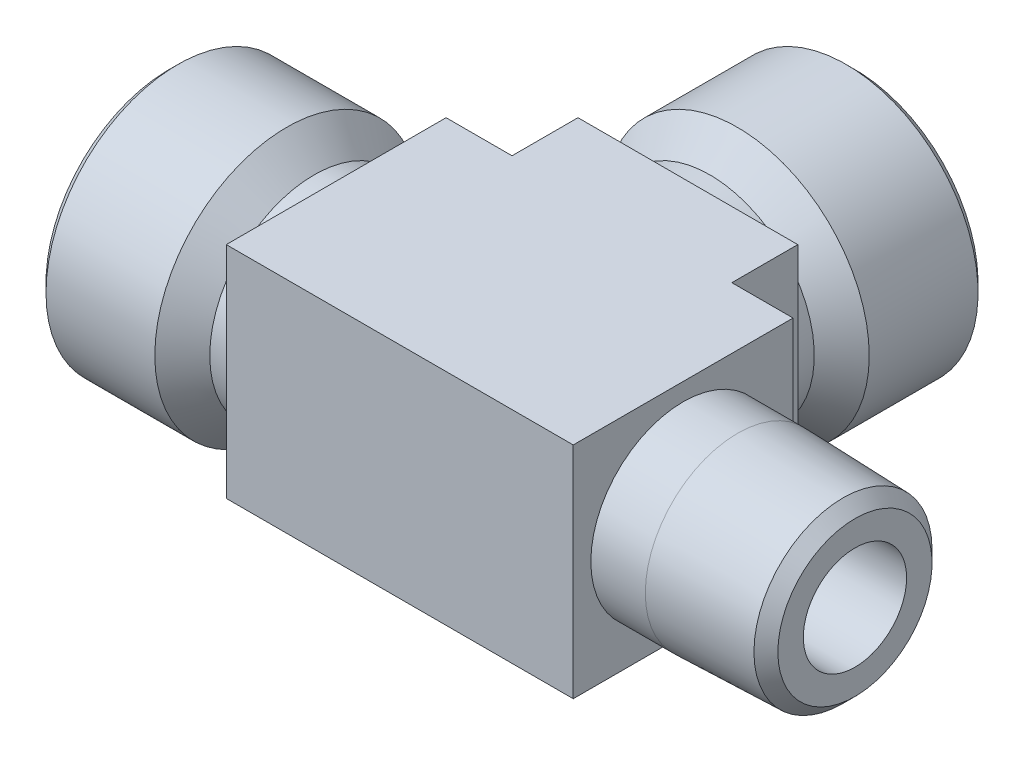
ISO-10303-21;
HEADER;
FILE_DESCRIPTION(('STEP AP214'),'2;1');
FILE_NAME('part.step','',(''),(''),'','','');
FILE_SCHEMA(('AUTOMOTIVE_DESIGN { 1 0 10303 214 1 1 1 1 }'));
ENDSEC;
DATA;
#1=APPLICATION_CONTEXT('core data for automotive mechanical design processes');
#2=APPLICATION_PROTOCOL_DEFINITION('international standard','automotive_design',2000,#1);
#3=PRODUCT_CONTEXT('',#1,'mechanical');
#4=PRODUCT('Part','Part','',(#3));
#5=PRODUCT_RELATED_PRODUCT_CATEGORY('part','',(#4));
#6=PRODUCT_DEFINITION_FORMATION('','',#4);
#7=PRODUCT_DEFINITION_CONTEXT('part definition',#1,'design');
#8=PRODUCT_DEFINITION('design','',#6,#7);
#9=PRODUCT_DEFINITION_SHAPE('','',#8);
#10=(LENGTH_UNIT() NAMED_UNIT(*) SI_UNIT(.MILLI.,.METRE.));
#11=(NAMED_UNIT(*) PLANE_ANGLE_UNIT() SI_UNIT($,.RADIAN.));
#12=(NAMED_UNIT(*) SI_UNIT($,.STERADIAN.) SOLID_ANGLE_UNIT());
#13=UNCERTAINTY_MEASURE_WITH_UNIT(LENGTH_MEASURE(1.E-05),#10,'distance_accuracy_value','');
#14=(GEOMETRIC_REPRESENTATION_CONTEXT(3) GLOBAL_UNCERTAINTY_ASSIGNED_CONTEXT((#13)) GLOBAL_UNIT_ASSIGNED_CONTEXT((#10,
#11,#12)) REPRESENTATION_CONTEXT('',''));
#15=CARTESIAN_POINT('',(0.,0.,0.));
#16=DIRECTION('',(0.,0.,1.));
#17=DIRECTION('',(1.,0.,0.));
#18=AXIS2_PLACEMENT_3D('',#15,#16,#17);
#19=CARTESIAN_POINT('',(39.624,0.,-19.812));
#20=DIRECTION('',(0.,0.,1.));
#21=DIRECTION('',(1.,0.,0.));
#22=AXIS2_PLACEMENT_3D('',#19,#20,#21);
#23=CYLINDRICAL_SURFACE('',#22,8.84936340276164);
#24=CARTESIAN_POINT('',(39.624,0.,0.));
#25=DIRECTION('',(-0.707106781186548,0.,0.707106781186547));
#26=DIRECTION('',(0.707106781186547,0.,0.707106781186547));
#27=AXIS2_PLACEMENT_3D('',#24,#25,#26);
#28=ELLIPSE('',#27,12.5148897425536,8.84936340276164);
#29=CARTESIAN_POINT('',(39.624,8.84936340276164,0.));
#30=VERTEX_POINT('',#29);
#31=CARTESIAN_POINT('',(39.624,-8.84936340276164,0.));
#32=VERTEX_POINT('',#31);
#33=EDGE_CURVE('E101',#30,#32,#28,.T.);
#34=ORIENTED_EDGE('',*,*,#33,.T.);
#35=CARTESIAN_POINT('',(39.624,0.,0.));
#36=DIRECTION('',(0.707106781186547,0.,0.707106781186547));
#37=DIRECTION('',(-0.707106781186548,0.,0.707106781186547));
#38=AXIS2_PLACEMENT_3D('',#35,#36,#37);
#39=ELLIPSE('',#38,12.5148897425536,8.84936340276164);
#40=CARTESIAN_POINT('',(48.4733634027616,0.,-8.84936340276163));
#41=VERTEX_POINT('',#40);
#42=EDGE_CURVE('E19',#32,#41,#39,.T.);
#43=ORIENTED_EDGE('',*,*,#42,.T.);
#44=CARTESIAN_POINT('',(39.624,0.,0.));
#45=DIRECTION('',(0.707106781186547,0.,0.707106781186547));
#46=DIRECTION('',(-0.707106781186548,0.,0.707106781186547));
#47=AXIS2_PLACEMENT_3D('',#44,#45,#46);
#48=ELLIPSE('',#47,12.5148897425536,8.84936340276164);
#49=EDGE_CURVE('E93',#41,#30,#48,.T.);
#50=ORIENTED_EDGE('',*,*,#49,.T.);
#51=EDGE_LOOP('',(#34,#43,#50));
#52=FACE_BOUND('',#51,.T.);
#53=CARTESIAN_POINT('',(39.624,0.,-26.05278));
#54=DIRECTION('',(0.,0.,-1.));
#55=DIRECTION('',(1.,0.,0.));
#56=AXIS2_PLACEMENT_3D('',#53,#54,#55);
#57=CIRCLE('',#56,8.84936340276164);
#58=CARTESIAN_POINT('',(48.4733634027616,0.,-26.05278));
#59=VERTEX_POINT('',#58);
#60=EDGE_CURVE('E109',#59,#59,#57,.T.);
#61=ORIENTED_EDGE('',*,*,#60,.T.);
#62=EDGE_LOOP('',(#61));
#63=FACE_BOUND('',#62,.T.);
#64=ADVANCED_FACE('F16',(#52,#63),#23,.F.);
#65=CARTESIAN_POINT('',(1.45135600000002,0.,0.));
#66=DIRECTION('',(-1.,0.,0.));
#67=DIRECTION('',(0.,0.,1.));
#68=AXIS2_PLACEMENT_3D('',#65,#66,#67);
#69=CONICAL_SURFACE('',#68,9.160383,0.0256563400043175);
#70=CARTESIAN_POINT('',(13.57122,0.,0.));
#71=DIRECTION('',(1.,0.,0.));
#72=DIRECTION('',(0.,0.,-1.));
#73=AXIS2_PLACEMENT_3D('',#70,#71,#72);
#74=CIRCLE('',#73,8.84936340276164);
#75=CARTESIAN_POINT('',(13.57122,0.,-8.84936340276164));
#76=VERTEX_POINT('',#75);
#77=EDGE_CURVE('E102',#76,#76,#74,.T.);
#78=ORIENTED_EDGE('',*,*,#77,.T.);
#79=EDGE_LOOP('',(#78));
#80=FACE_BOUND('',#79,.T.);
#81=CARTESIAN_POINT('',(1.451356,0.,0.));
#82=DIRECTION('',(-1.,0.,0.));
#83=DIRECTION('',(0.,0.,-1.));
#84=AXIS2_PLACEMENT_3D('',#81,#82,#83);
#85=CIRCLE('',#84,9.160383);
#86=CARTESIAN_POINT('',(1.451356,0.,-9.160383));
#87=VERTEX_POINT('',#86);
#88=EDGE_CURVE('E96',#87,#87,#85,.T.);
#89=ORIENTED_EDGE('',*,*,#88,.T.);
#90=EDGE_LOOP('',(#89));
#91=FACE_BOUND('',#90,.T.);
#92=ADVANCED_FACE('F326',(#80,#91),#69,.F.);
#93=CARTESIAN_POINT('',(24.2366817013808,0.,0.));
#94=DIRECTION('',(1.,0.,0.));
#95=DIRECTION('',(0.,0.,-1.));
#96=AXIS2_PLACEMENT_3D('',#93,#94,#95);
#97=CYLINDRICAL_SURFACE('',#96,8.84936340276164);
#98=CARTESIAN_POINT('',(48.4733634027616,0.,0.));
#99=DIRECTION('',(-1.,0.,0.));
#100=DIRECTION('',(0.,0.,-1.));
#101=AXIS2_PLACEMENT_3D('',#98,#99,#100);
#102=CIRCLE('',#101,8.84936340276164);
#103=EDGE_CURVE('E88',#41,#41,#102,.F.);
#104=ORIENTED_EDGE('',*,*,#103,.T.);
#105=ORIENTED_EDGE('',*,*,#42,.F.);
#106=ORIENTED_EDGE('',*,*,#33,.F.);
#107=ORIENTED_EDGE('',*,*,#49,.F.);
#108=EDGE_LOOP('',(#104,#105,#106,#107));
#109=FACE_BOUND('',#108,.T.);
#110=ORIENTED_EDGE('',*,*,#77,.F.);
#111=EDGE_LOOP('',(#110));
#112=FACE_BOUND('',#111,.T.);
#113=ADVANCED_FACE('F90',(#109,#112),#97,.F.);
#114=CARTESIAN_POINT('',(39.624,0.,-38.172644));
#115=DIRECTION('',(0.,0.,-1.));
#116=DIRECTION('',(-1.,0.,0.));
#117=AXIS2_PLACEMENT_3D('',#114,#115,#116);
#118=CONICAL_SURFACE('',#117,9.160383,0.025656340004316);
#119=ORIENTED_EDGE('',*,*,#60,.F.);
#120=EDGE_LOOP('',(#119));
#121=FACE_BOUND('',#120,.T.);
#122=CARTESIAN_POINT('',(39.624,0.,-38.172644));
#123=DIRECTION('',(0.,0.,-1.));
#124=DIRECTION('',(1.,0.,0.));
#125=AXIS2_PLACEMENT_3D('',#122,#123,#124);
#126=CIRCLE('',#125,9.16038300000001);
#127=CARTESIAN_POINT('',(48.784383,0.,-38.172644));
#128=VERTEX_POINT('',#127);
#129=EDGE_CURVE('E95',#128,#128,#126,.T.);
#130=ORIENTED_EDGE('',*,*,#129,.T.);
#131=EDGE_LOOP('',(#130));
#132=FACE_BOUND('',#131,.T.);
#133=ADVANCED_FACE('F425',(#121,#132),#118,.F.);
#134=CARTESIAN_POINT('',(0.,0.,0.));
#135=DIRECTION('',(-1.,0.,0.));
#136=DIRECTION('',(0.,0.,1.));
#137=AXIS2_PLACEMENT_3D('',#134,#135,#136);
#138=CONICAL_SURFACE('',#137,10.611739,0.785398163397448);
#139=ORIENTED_EDGE('',*,*,#88,.F.);
#140=EDGE_LOOP('',(#139));
#141=FACE_BOUND('',#140,.T.);
#142=CARTESIAN_POINT('',(0.,0.,0.));
#143=DIRECTION('',(-1.,0.,0.));
#144=DIRECTION('',(0.,0.,1.));
#145=AXIS2_PLACEMENT_3D('',#142,#143,#144);
#146=CIRCLE('',#145,10.611739);
#147=CARTESIAN_POINT('',(0.,0.,10.611739));
#148=VERTEX_POINT('',#147);
#149=EDGE_CURVE('E144',#148,#148,#146,.F.);
#150=ORIENTED_EDGE('',*,*,#149,.F.);
#151=EDGE_LOOP('',(#150));
#152=FACE_BOUND('',#151,.T.);
#153=ADVANCED_FACE('F384',(#141,#152),#138,.F.);
#154=CARTESIAN_POINT('',(48.4733634027616,0.,0.));
#155=DIRECTION('',(-1.,0.,0.));
#156=DIRECTION('',(0.,-1.,0.));
#157=AXIS2_PLACEMENT_3D('',#154,#155,#156);
#158=CONICAL_SURFACE('',#157,8.84936340276164,0.449593460375112);
#159=CARTESIAN_POINT('',(54.4423634027616,0.,0.));
#160=DIRECTION('',(1.,0.,0.));
#161=DIRECTION('',(0.,0.,-1.));
#162=AXIS2_PLACEMENT_3D('',#159,#160,#161);
#163=CIRCLE('',#162,5.969);
#164=CARTESIAN_POINT('',(54.4423634027616,0.,-5.969));
#165=VERTEX_POINT('',#164);
#166=EDGE_CURVE('E143',#165,#165,#163,.T.);
#167=ORIENTED_EDGE('',*,*,#166,.T.);
#168=EDGE_LOOP('',(#167));
#169=FACE_BOUND('',#168,.T.);
#170=ORIENTED_EDGE('',*,*,#103,.F.);
#171=EDGE_LOOP('',(#170));
#172=FACE_BOUND('',#171,.T.);
#173=ADVANCED_FACE('F379',(#169,#172),#158,.F.);
#174=CARTESIAN_POINT('',(39.624,0.,-39.624));
#175=DIRECTION('',(0.,0.,-1.));
#176=DIRECTION('',(-1.,0.,0.));
#177=AXIS2_PLACEMENT_3D('',#174,#175,#176);
#178=CONICAL_SURFACE('',#177,10.611739,0.785398163397448);
#179=ORIENTED_EDGE('',*,*,#129,.F.);
#180=EDGE_LOOP('',(#179));
#181=FACE_BOUND('',#180,.T.);
#182=CARTESIAN_POINT('',(39.624,0.,-39.624));
#183=DIRECTION('',(0.,0.,-1.));
#184=DIRECTION('',(-1.,0.,0.));
#185=AXIS2_PLACEMENT_3D('',#182,#183,#184);
#186=CIRCLE('',#185,10.611739);
#187=CARTESIAN_POINT('',(29.012261,0.,-39.624));
#188=VERTEX_POINT('',#187);
#189=EDGE_CURVE('E140',#188,#188,#186,.F.);
#190=ORIENTED_EDGE('',*,*,#189,.F.);
#191=EDGE_LOOP('',(#190));
#192=FACE_BOUND('',#191,.T.);
#193=ADVANCED_FACE('F383',(#181,#192),#178,.F.);
#194=CARTESIAN_POINT('',(0.,0.,-7.62));
#195=DIRECTION('',(-1.,0.,0.));
#196=DIRECTION('',(0.,0.,1.));
#197=AXIS2_PLACEMENT_3D('',#194,#195,#196);
#198=PLANE('',#197);
#199=ORIENTED_EDGE('',*,*,#149,.T.);
#200=EDGE_LOOP('',(#199));
#201=FACE_BOUND('',#200,.T.);
#202=CARTESIAN_POINT('',(0.,0.,0.));
#203=DIRECTION('',(1.,0.,0.));
#204=DIRECTION('',(0.,0.,-1.));
#205=AXIS2_PLACEMENT_3D('',#202,#203,#204);
#206=CIRCLE('',#205,14.224);
#207=CARTESIAN_POINT('',(0.,0.,-14.224));
#208=VERTEX_POINT('',#207);
#209=EDGE_CURVE('E137',#208,#208,#206,.T.);
#210=ORIENTED_EDGE('',*,*,#209,.F.);
#211=EDGE_LOOP('',(#210));
#212=FACE_BOUND('',#211,.T.);
#213=ADVANCED_FACE('F458',(#201,#212),#198,.T.);
#214=CARTESIAN_POINT('',(69.32295,0.,0.));
#215=DIRECTION('',(1.,0.,0.));
#216=DIRECTION('',(0.,0.,-1.));
#217=AXIS2_PLACEMENT_3D('',#214,#215,#216);
#218=CYLINDRICAL_SURFACE('',#217,5.969);
#219=CARTESIAN_POINT('',(79.248,0.,0.));
#220=DIRECTION('',(1.,0.,0.));
#221=DIRECTION('',(0.,0.,-1.));
#222=AXIS2_PLACEMENT_3D('',#219,#220,#221);
#223=CIRCLE('',#222,5.969);
#224=CARTESIAN_POINT('',(79.248,0.,-5.969));
#225=VERTEX_POINT('',#224);
#226=EDGE_CURVE('E134',#225,#225,#223,.F.);
#227=ORIENTED_EDGE('',*,*,#226,.F.);
#228=EDGE_LOOP('',(#227));
#229=FACE_BOUND('',#228,.T.);
#230=ORIENTED_EDGE('',*,*,#166,.F.);
#231=EDGE_LOOP('',(#230));
#232=FACE_BOUND('',#231,.T.);
#233=ADVANCED_FACE('F470',(#229,#232),#218,.F.);
#234=CARTESIAN_POINT('',(47.244,0.,-39.624));
#235=DIRECTION('',(0.,0.,-1.));
#236=DIRECTION('',(-1.,0.,0.));
#237=AXIS2_PLACEMENT_3D('',#234,#235,#236);
#238=PLANE('',#237);
#239=ORIENTED_EDGE('',*,*,#189,.T.);
#240=EDGE_LOOP('',(#239));
#241=FACE_BOUND('',#240,.T.);
#242=CARTESIAN_POINT('',(39.624,0.,-39.624));
#243=DIRECTION('',(0.,0.,1.));
#244=DIRECTION('',(0.,-1.,0.));
#245=AXIS2_PLACEMENT_3D('',#242,#243,#244);
#246=CIRCLE('',#245,14.224);
#247=CARTESIAN_POINT('',(39.624,-14.224,-39.624));
#248=VERTEX_POINT('',#247);
#249=EDGE_CURVE('E131',#248,#248,#246,.T.);
#250=ORIENTED_EDGE('',*,*,#249,.F.);
#251=EDGE_LOOP('',(#250));
#252=FACE_BOUND('',#251,.T.);
#253=ADVANCED_FACE('F482',(#241,#252),#238,.T.);
#254=CARTESIAN_POINT('',(1.016,0.,0.));
#255=DIRECTION('',(1.,0.,0.));
#256=DIRECTION('',(0.,0.,-1.));
#257=AXIS2_PLACEMENT_3D('',#254,#255,#256);
#258=CONICAL_SURFACE('',#257,15.24,0.785398163397449);
#259=ORIENTED_EDGE('',*,*,#209,.T.);
#260=EDGE_LOOP('',(#259));
#261=FACE_BOUND('',#260,.T.);
#262=CARTESIAN_POINT('',(1.016,0.,0.));
#263=DIRECTION('',(-1.,0.,0.));
#264=DIRECTION('',(0.,0.,1.));
#265=AXIS2_PLACEMENT_3D('',#262,#263,#264);
#266=CIRCLE('',#265,15.24);
#267=CARTESIAN_POINT('',(1.016,0.,15.24));
#268=VERTEX_POINT('',#267);
#269=EDGE_CURVE('E130',#268,#268,#266,.F.);
#270=ORIENTED_EDGE('',*,*,#269,.F.);
#271=EDGE_LOOP('',(#270));
#272=FACE_BOUND('',#271,.T.);
#273=ADVANCED_FACE('F371',(#261,#272),#258,.T.);
#274=CARTESIAN_POINT('',(79.248,0.,-5.12296664965317));
#275=DIRECTION('',(1.,0.,0.));
#276=DIRECTION('',(0.,0.,-1.));
#277=AXIS2_PLACEMENT_3D('',#274,#275,#276);
#278=PLANE('',#277);
#279=CARTESIAN_POINT('',(79.248,0.,0.));
#280=DIRECTION('',(-1.,0.,0.));
#281=DIRECTION('',(0.,0.,1.));
#282=AXIS2_PLACEMENT_3D('',#279,#280,#281);
#283=CIRCLE('',#282,8.90650999999998);
#284=CARTESIAN_POINT('',(79.248,0.,8.90650999999998));
#285=VERTEX_POINT('',#284);
#286=EDGE_CURVE('E126',#285,#285,#283,.T.);
#287=ORIENTED_EDGE('',*,*,#286,.F.);
#288=EDGE_LOOP('',(#287));
#289=FACE_BOUND('',#288,.T.);
#290=ORIENTED_EDGE('',*,*,#226,.T.);
#291=EDGE_LOOP('',(#290));
#292=FACE_BOUND('',#291,.T.);
#293=ADVANCED_FACE('F354',(#289,#292),#278,.T.);
#294=CARTESIAN_POINT('',(39.624,0.,-38.608));
#295=DIRECTION('',(0.,0.,1.));
#296=DIRECTION('',(0.,-1.,0.));
#297=AXIS2_PLACEMENT_3D('',#294,#295,#296);
#298=CONICAL_SURFACE('',#297,15.24,0.785398163397448);
#299=CARTESIAN_POINT('',(39.624,0.,-38.608));
#300=DIRECTION('',(0.,0.,-1.));
#301=DIRECTION('',(-1.,0.,0.));
#302=AXIS2_PLACEMENT_3D('',#299,#300,#301);
#303=CIRCLE('',#302,15.24);
#304=CARTESIAN_POINT('',(24.384,0.,-38.608));
#305=VERTEX_POINT('',#304);
#306=EDGE_CURVE('E129',#305,#305,#303,.F.);
#307=ORIENTED_EDGE('',*,*,#306,.F.);
#308=EDGE_LOOP('',(#307));
#309=FACE_BOUND('',#308,.T.);
#310=ORIENTED_EDGE('',*,*,#249,.T.);
#311=EDGE_LOOP('',(#310));
#312=FACE_BOUND('',#311,.T.);
#313=ADVANCED_FACE('F349',(#309,#312),#298,.T.);
#314=CARTESIAN_POINT('',(8.382,0.,0.));
#315=DIRECTION('',(-1.,0.,0.));
#316=DIRECTION('',(0.,0.,1.));
#317=AXIS2_PLACEMENT_3D('',#314,#315,#316);
#318=CYLINDRICAL_SURFACE('',#317,15.24);
#319=CARTESIAN_POINT('',(13.589,0.,0.));
#320=DIRECTION('',(-1.,0.,0.));
#321=DIRECTION('',(0.,0.,-1.));
#322=AXIS2_PLACEMENT_3D('',#319,#320,#321);
#323=CIRCLE('',#322,15.24);
#324=CARTESIAN_POINT('',(13.589,0.,-15.24));
#325=VERTEX_POINT('',#324);
#326=EDGE_CURVE('E163',#325,#325,#323,.F.);
#327=ORIENTED_EDGE('',*,*,#326,.F.);
#328=EDGE_LOOP('',(#327));
#329=FACE_BOUND('',#328,.T.);
#330=ORIENTED_EDGE('',*,*,#269,.T.);
#331=EDGE_LOOP('',(#330));
#332=FACE_BOUND('',#331,.T.);
#333=ADVANCED_FACE('F306',(#329,#332),#318,.T.);
#334=CARTESIAN_POINT('',(77.8655334766456,0.,0.));
#335=DIRECTION('',(-1.,0.,0.));
#336=DIRECTION('',(0.,0.,1.));
#337=AXIS2_PLACEMENT_3D('',#334,#335,#336);
#338=CONICAL_SURFACE('',#337,10.2889765233544,0.785398163397448);
#339=CARTESIAN_POINT('',(77.8655334766456,0.,0.));
#340=DIRECTION('',(-1.,0.,0.));
#341=DIRECTION('',(0.,0.,-1.));
#342=AXIS2_PLACEMENT_3D('',#339,#340,#341);
#343=CIRCLE('',#342,10.2889765233545);
#344=CARTESIAN_POINT('',(77.8655334766456,0.,-10.2889765233545));
#345=VERTEX_POINT('',#344);
#346=EDGE_CURVE('E166',#345,#345,#343,.T.);
#347=ORIENTED_EDGE('',*,*,#346,.F.);
#348=EDGE_LOOP('',(#347));
#349=FACE_BOUND('',#348,.T.);
#350=ORIENTED_EDGE('',*,*,#286,.T.);
#351=EDGE_LOOP('',(#350));
#352=FACE_BOUND('',#351,.T.);
#353=ADVANCED_FACE('F520',(#349,#352),#338,.T.);
#354=CARTESIAN_POINT('',(39.624,0.,-31.242));
#355=DIRECTION('',(0.,0.,-1.));
#356=DIRECTION('',(-1.,0.,0.));
#357=AXIS2_PLACEMENT_3D('',#354,#355,#356);
#358=CYLINDRICAL_SURFACE('',#357,15.24);
#359=CARTESIAN_POINT('',(39.624,0.,-26.035));
#360=DIRECTION('',(0.,0.,-1.));
#361=DIRECTION('',(1.,0.,0.));
#362=AXIS2_PLACEMENT_3D('',#359,#360,#361);
#363=CIRCLE('',#362,15.24);
#364=CARTESIAN_POINT('',(54.864,0.,-26.035));
#365=VERTEX_POINT('',#364);
#366=EDGE_CURVE('E169',#365,#365,#363,.F.);
#367=ORIENTED_EDGE('',*,*,#366,.F.);
#368=EDGE_LOOP('',(#367));
#369=FACE_BOUND('',#368,.T.);
#370=ORIENTED_EDGE('',*,*,#306,.T.);
#371=EDGE_LOOP('',(#370));
#372=FACE_BOUND('',#371,.T.);
#373=ADVANCED_FACE('F531',(#369,#372),#358,.T.);
#374=CARTESIAN_POINT('',(13.589,0.,0.));
#375=DIRECTION('',(-1.,0.,0.));
#376=DIRECTION('',(0.,0.,1.));
#377=AXIS2_PLACEMENT_3D('',#374,#375,#376);
#378=CONICAL_SURFACE('',#377,15.24,0.785398163397448);
#379=CARTESIAN_POINT('',(16.764,0.,0.));
#380=DIRECTION('',(-1.,0.,0.));
#381=DIRECTION('',(0.,0.,1.));
#382=AXIS2_PLACEMENT_3D('',#379,#380,#381);
#383=CIRCLE('',#382,12.065);
#384=CARTESIAN_POINT('',(16.764,0.,12.065));
#385=VERTEX_POINT('',#384);
#386=EDGE_CURVE('E172',#385,#385,#383,.F.);
#387=ORIENTED_EDGE('',*,*,#386,.F.);
#388=EDGE_LOOP('',(#387));
#389=FACE_BOUND('',#388,.T.);
#390=ORIENTED_EDGE('',*,*,#326,.T.);
#391=EDGE_LOOP('',(#390));
#392=FACE_BOUND('',#391,.T.);
#393=ADVANCED_FACE('F543',(#389,#392),#378,.T.);
#394=CARTESIAN_POINT('',(65.6920200000001,0.,0.));
#395=DIRECTION('',(-1.,0.,0.));
#396=DIRECTION('',(0.,0.,1.));
#397=AXIS2_PLACEMENT_3D('',#394,#395,#396);
#398=CONICAL_SURFACE('',#397,10.668,0.0311250383214148);
#399=CARTESIAN_POINT('',(65.69202,0.,0.));
#400=DIRECTION('',(-1.,0.,0.));
#401=DIRECTION('',(0.,0.,1.));
#402=AXIS2_PLACEMENT_3D('',#399,#400,#401);
#403=CIRCLE('',#402,10.668);
#404=CARTESIAN_POINT('',(65.69202,0.,10.668));
#405=VERTEX_POINT('',#404);
#406=EDGE_CURVE('E175',#405,#405,#403,.T.);
#407=ORIENTED_EDGE('',*,*,#406,.F.);
#408=EDGE_LOOP('',(#407));
#409=FACE_BOUND('',#408,.T.);
#410=ORIENTED_EDGE('',*,*,#346,.T.);
#411=EDGE_LOOP('',(#410));
#412=FACE_BOUND('',#411,.T.);
#413=ADVANCED_FACE('F555',(#409,#412),#398,.T.);
#414=CARTESIAN_POINT('',(39.624,0.,-26.035));
#415=DIRECTION('',(0.,0.,-1.));
#416=DIRECTION('',(0.,1.,0.));
#417=AXIS2_PLACEMENT_3D('',#414,#415,#416);
#418=CONICAL_SURFACE('',#417,15.24,0.785398163397448);
#419=CARTESIAN_POINT('',(39.624,0.,-22.86));
#420=DIRECTION('',(0.,0.,-1.));
#421=DIRECTION('',(-1.,0.,0.));
#422=AXIS2_PLACEMENT_3D('',#419,#420,#421);
#423=CIRCLE('',#422,12.065);
#424=CARTESIAN_POINT('',(27.559,0.,-22.86));
#425=VERTEX_POINT('',#424);
#426=EDGE_CURVE('E178',#425,#425,#423,.F.);
#427=ORIENTED_EDGE('',*,*,#426,.F.);
#428=EDGE_LOOP('',(#427));
#429=FACE_BOUND('',#428,.T.);
#430=ORIENTED_EDGE('',*,*,#366,.T.);
#431=EDGE_LOOP('',(#430));
#432=FACE_BOUND('',#431,.T.);
#433=ADVANCED_FACE('F567',(#429,#432),#418,.T.);
#434=CARTESIAN_POINT('',(18.034,0.,0.));
#435=DIRECTION('',(-1.,0.,0.));
#436=DIRECTION('',(0.,0.,1.));
#437=AXIS2_PLACEMENT_3D('',#434,#435,#436);
#438=CYLINDRICAL_SURFACE('',#437,12.065);
#439=CARTESIAN_POINT('',(19.304,0.,0.));
#440=DIRECTION('',(-1.,0.,0.));
#441=DIRECTION('',(0.,0.,1.));
#442=AXIS2_PLACEMENT_3D('',#439,#440,#441);
#443=CIRCLE('',#442,12.065);
#444=CARTESIAN_POINT('',(19.304,0.,12.065));
#445=VERTEX_POINT('',#444);
#446=EDGE_CURVE('E121',#445,#445,#443,.F.);
#447=ORIENTED_EDGE('',*,*,#446,.F.);
#448=EDGE_LOOP('',(#447));
#449=FACE_BOUND('',#448,.T.);
#450=ORIENTED_EDGE('',*,*,#386,.T.);
#451=EDGE_LOOP('',(#450));
#452=FACE_BOUND('',#451,.T.);
#453=ADVANCED_FACE('F579',(#449,#452),#438,.T.);
#454=CARTESIAN_POINT('',(62.54496,0.,0.));
#455=DIRECTION('',(-1.,0.,0.));
#456=DIRECTION('',(0.,0.,1.));
#457=AXIS2_PLACEMENT_3D('',#454,#455,#456);
#458=CYLINDRICAL_SURFACE('',#457,10.668);
#459=CARTESIAN_POINT('',(59.3979,0.,0.));
#460=DIRECTION('',(-1.,0.,0.));
#461=DIRECTION('',(0.,0.,1.));
#462=AXIS2_PLACEMENT_3D('',#459,#460,#461);
#463=CIRCLE('',#462,10.668);
#464=CARTESIAN_POINT('',(59.3979,0.,10.668));
#465=VERTEX_POINT('',#464);
#466=EDGE_CURVE('E116',#465,#465,#463,.T.);
#467=ORIENTED_EDGE('',*,*,#466,.F.);
#468=EDGE_LOOP('',(#467));
#469=FACE_BOUND('',#468,.T.);
#470=ORIENTED_EDGE('',*,*,#406,.T.);
#471=EDGE_LOOP('',(#470));
#472=FACE_BOUND('',#471,.T.);
#473=ADVANCED_FACE('F591',(#469,#472),#458,.T.);
#474=CARTESIAN_POINT('',(39.624,0.,-21.59));
#475=DIRECTION('',(0.,0.,-1.));
#476=DIRECTION('',(-1.,0.,0.));
#477=AXIS2_PLACEMENT_3D('',#474,#475,#476);
#478=CYLINDRICAL_SURFACE('',#477,12.065);
#479=CARTESIAN_POINT('',(39.624,0.,-20.32));
#480=DIRECTION('',(0.,0.,-1.));
#481=DIRECTION('',(-1.,0.,0.));
#482=AXIS2_PLACEMENT_3D('',#479,#480,#481);
#483=CIRCLE('',#482,12.065);
#484=CARTESIAN_POINT('',(27.559,0.,-20.32));
#485=VERTEX_POINT('',#484);
#486=EDGE_CURVE('E111',#485,#485,#483,.F.);
#487=ORIENTED_EDGE('',*,*,#486,.F.);
#488=EDGE_LOOP('',(#487));
#489=FACE_BOUND('',#488,.T.);
#490=ORIENTED_EDGE('',*,*,#426,.T.);
#491=EDGE_LOOP('',(#490));
#492=FACE_BOUND('',#491,.T.);
#493=ADVANCED_FACE('F342',(#489,#492),#478,.T.);
#494=CARTESIAN_POINT('',(19.304,-12.7,-12.7));
#495=DIRECTION('',(0.,-1.,0.));
#496=DIRECTION('',(1.,0.,0.));
#497=AXIS2_PLACEMENT_3D('',#494,#495,#496);
#498=PLANE('',#497);
#499=DIRECTION('',(0.,0.,1.));
#500=VECTOR('',#499,1.);
#501=CARTESIAN_POINT('',(19.304,-12.7,-6.35));
#502=LINE('',#501,#500);
#503=CARTESIAN_POINT('',(19.304,-12.7,-12.7));
#504=VERTEX_POINT('',#503);
#505=CARTESIAN_POINT('',(19.304,-12.7,12.7));
#506=VERTEX_POINT('',#505);
#507=EDGE_CURVE('E124',#504,#506,#502,.T.);
#508=ORIENTED_EDGE('',*,*,#507,.F.);
#509=DIRECTION('',(-1.,0.,0.));
#510=VECTOR('',#509,1.);
#511=CARTESIAN_POINT('',(19.304,-12.7,-12.7));
#512=LINE('',#511,#510);
#513=CARTESIAN_POINT('',(26.924,-12.7,-12.7));
#514=VERTEX_POINT('',#513);
#515=EDGE_CURVE('E125',#514,#504,#512,.T.);
#516=ORIENTED_EDGE('',*,*,#515,.F.);
#517=DIRECTION('',(0.,0.,1.));
#518=VECTOR('',#517,1.);
#519=CARTESIAN_POINT('',(26.924,-12.7,0.));
#520=LINE('',#519,#518);
#521=CARTESIAN_POINT('',(26.924,-12.7,-20.32));
#522=VERTEX_POINT('',#521);
#523=EDGE_CURVE('E210',#522,#514,#520,.T.);
#524=ORIENTED_EDGE('',*,*,#523,.F.);
#525=DIRECTION('',(-1.,0.,0.));
#526=VECTOR('',#525,1.);
#527=CARTESIAN_POINT('',(45.974,-12.7,-20.32));
#528=LINE('',#527,#526);
#529=CARTESIAN_POINT('',(52.324,-12.7,-20.32));
#530=VERTEX_POINT('',#529);
#531=EDGE_CURVE('E114',#530,#522,#528,.T.);
#532=ORIENTED_EDGE('',*,*,#531,.F.);
#533=DIRECTION('',(0.,0.,-1.));
#534=VECTOR('',#533,1.);
#535=CARTESIAN_POINT('',(52.324,-12.7,0.));
#536=LINE('',#535,#534);
#537=CARTESIAN_POINT('',(52.324,-12.7,-12.7));
#538=VERTEX_POINT('',#537);
#539=EDGE_CURVE('E115',#538,#530,#536,.T.);
#540=ORIENTED_EDGE('',*,*,#539,.F.);
#541=DIRECTION('',(-1.,0.,0.));
#542=VECTOR('',#541,1.);
#543=CARTESIAN_POINT('',(19.304,-12.7,-12.7));
#544=LINE('',#543,#542);
#545=CARTESIAN_POINT('',(59.3979,-12.7,-12.7));
#546=VERTEX_POINT('',#545);
#547=EDGE_CURVE('E198',#546,#538,#544,.T.);
#548=ORIENTED_EDGE('',*,*,#547,.F.);
#549=DIRECTION('',(0.,0.,-1.));
#550=VECTOR('',#549,1.);
#551=CARTESIAN_POINT('',(59.3979,-12.7,-6.35));
#552=LINE('',#551,#550);
#553=CARTESIAN_POINT('',(59.3979,-12.7,12.7));
#554=VERTEX_POINT('',#553);
#555=EDGE_CURVE('E120',#554,#546,#552,.T.);
#556=ORIENTED_EDGE('',*,*,#555,.F.);
#557=DIRECTION('',(1.,0.,0.));
#558=VECTOR('',#557,1.);
#559=CARTESIAN_POINT('',(19.304,-12.7,12.7));
#560=LINE('',#559,#558);
#561=EDGE_CURVE('E190',#506,#554,#560,.T.);
#562=ORIENTED_EDGE('',*,*,#561,.F.);
#563=EDGE_LOOP('',(#508,#516,#524,#532,#540,#548,#556,#562));
#564=FACE_BOUND('',#563,.T.);
#565=ADVANCED_FACE('F246',(#564),#498,.T.);
#566=CARTESIAN_POINT('',(19.304,12.7,-12.7));
#567=DIRECTION('',(0.,0.,-1.));
#568=DIRECTION('',(-1.,0.,0.));
#569=AXIS2_PLACEMENT_3D('',#566,#567,#568);
#570=PLANE('',#569);
#571=DIRECTION('',(0.,1.,0.));
#572=VECTOR('',#571,1.);
#573=CARTESIAN_POINT('',(19.304,0.,-12.7));
#574=LINE('',#573,#572);
#575=CARTESIAN_POINT('',(19.304,12.7,-12.7));
#576=VERTEX_POINT('',#575);
#577=EDGE_CURVE('E184',#576,#504,#574,.F.);
#578=ORIENTED_EDGE('',*,*,#577,.F.);
#579=DIRECTION('',(-1.,0.,0.));
#580=VECTOR('',#579,1.);
#581=CARTESIAN_POINT('',(19.304,12.7,-12.7));
#582=LINE('',#581,#580);
#583=CARTESIAN_POINT('',(26.924,12.7,-12.7));
#584=VERTEX_POINT('',#583);
#585=EDGE_CURVE('E216',#584,#576,#582,.T.);
#586=ORIENTED_EDGE('',*,*,#585,.F.);
#587=DIRECTION('',(0.,1.,0.));
#588=VECTOR('',#587,1.);
#589=CARTESIAN_POINT('',(26.924,12.7,-12.7));
#590=LINE('',#589,#588);
#591=EDGE_CURVE('E213',#514,#584,#590,.T.);
#592=ORIENTED_EDGE('',*,*,#591,.F.);
#593=ORIENTED_EDGE('',*,*,#515,.T.);
#594=EDGE_LOOP('',(#578,#586,#592,#593));
#595=FACE_BOUND('',#594,.T.);
#596=ADVANCED_FACE('F252',(#595),#570,.T.);
#597=CARTESIAN_POINT('',(19.304,0.,-6.35));
#598=DIRECTION('',(-1.,0.,0.));
#599=DIRECTION('',(0.,0.,1.));
#600=AXIS2_PLACEMENT_3D('',#597,#598,#599);
#601=PLANE('',#600);
#602=DIRECTION('',(0.,0.,1.));
#603=VECTOR('',#602,1.);
#604=CARTESIAN_POINT('',(19.304,12.7,12.7));
#605=LINE('',#604,#603);
#606=CARTESIAN_POINT('',(19.304,12.7,12.7));
#607=VERTEX_POINT('',#606);
#608=EDGE_CURVE('E219',#576,#607,#605,.T.);
#609=ORIENTED_EDGE('',*,*,#608,.F.);
#610=ORIENTED_EDGE('',*,*,#577,.T.);
#611=ORIENTED_EDGE('',*,*,#507,.T.);
#612=DIRECTION('',(0.,1.,0.));
#613=VECTOR('',#612,1.);
#614=CARTESIAN_POINT('',(19.304,-12.7,12.7));
#615=LINE('',#614,#613);
#616=EDGE_CURVE('E187',#607,#506,#615,.F.);
#617=ORIENTED_EDGE('',*,*,#616,.F.);
#618=EDGE_LOOP('',(#609,#610,#611,#617));
#619=FACE_BOUND('',#618,.T.);
#620=ORIENTED_EDGE('',*,*,#446,.T.);
#621=EDGE_LOOP('',(#620));
#622=FACE_BOUND('',#621,.T.);
#623=ADVANCED_FACE('F256',(#619,#622),#601,.T.);
#624=CARTESIAN_POINT('',(19.304,-12.7,12.7));
#625=DIRECTION('',(0.,0.,1.));
#626=DIRECTION('',(1.,0.,0.));
#627=AXIS2_PLACEMENT_3D('',#624,#625,#626);
#628=PLANE('',#627);
#629=DIRECTION('',(0.,1.,0.));
#630=VECTOR('',#629,1.);
#631=CARTESIAN_POINT('',(59.3979,0.,12.7));
#632=LINE('',#631,#630);
#633=CARTESIAN_POINT('',(59.3979,12.7,12.7));
#634=VERTEX_POINT('',#633);
#635=EDGE_CURVE('E192',#634,#554,#632,.F.);
#636=ORIENTED_EDGE('',*,*,#635,.F.);
#637=DIRECTION('',(-1.,0.,0.));
#638=VECTOR('',#637,1.);
#639=CARTESIAN_POINT('',(19.304,12.7,12.7));
#640=LINE('',#639,#638);
#641=EDGE_CURVE('E222',#607,#634,#640,.F.);
#642=ORIENTED_EDGE('',*,*,#641,.F.);
#643=ORIENTED_EDGE('',*,*,#616,.T.);
#644=ORIENTED_EDGE('',*,*,#561,.T.);
#645=EDGE_LOOP('',(#636,#642,#643,#644));
#646=FACE_BOUND('',#645,.T.);
#647=ADVANCED_FACE('F260',(#646),#628,.T.);
#648=CARTESIAN_POINT('',(59.3979,0.,-6.35));
#649=DIRECTION('',(1.,0.,0.));
#650=DIRECTION('',(0.,0.,-1.));
#651=AXIS2_PLACEMENT_3D('',#648,#649,#650);
#652=PLANE('',#651);
#653=ORIENTED_EDGE('',*,*,#466,.T.);
#654=EDGE_LOOP('',(#653));
#655=FACE_BOUND('',#654,.T.);
#656=ORIENTED_EDGE('',*,*,#555,.T.);
#657=DIRECTION('',(0.,1.,0.));
#658=VECTOR('',#657,1.);
#659=CARTESIAN_POINT('',(59.3979,12.7,-12.7));
#660=LINE('',#659,#658);
#661=CARTESIAN_POINT('',(59.3979,12.7,-12.7));
#662=VERTEX_POINT('',#661);
#663=EDGE_CURVE('E119',#662,#546,#660,.F.);
#664=ORIENTED_EDGE('',*,*,#663,.F.);
#665=DIRECTION('',(0.,0.,1.));
#666=VECTOR('',#665,1.);
#667=CARTESIAN_POINT('',(59.3979,12.7,12.7));
#668=LINE('',#667,#666);
#669=EDGE_CURVE('E225',#634,#662,#668,.F.);
#670=ORIENTED_EDGE('',*,*,#669,.F.);
#671=ORIENTED_EDGE('',*,*,#635,.T.);
#672=EDGE_LOOP('',(#656,#664,#670,#671));
#673=FACE_BOUND('',#672,.T.);
#674=ADVANCED_FACE('F263',(#655,#673),#652,.T.);
#675=CARTESIAN_POINT('',(19.304,12.7,-12.7));
#676=DIRECTION('',(0.,0.,-1.));
#677=DIRECTION('',(-1.,0.,0.));
#678=AXIS2_PLACEMENT_3D('',#675,#676,#677);
#679=PLANE('',#678);
#680=ORIENTED_EDGE('',*,*,#663,.T.);
#681=ORIENTED_EDGE('',*,*,#547,.T.);
#682=DIRECTION('',(0.,1.,0.));
#683=VECTOR('',#682,1.);
#684=CARTESIAN_POINT('',(52.324,-12.7,-12.7));
#685=LINE('',#684,#683);
#686=CARTESIAN_POINT('',(52.324,12.7,-12.7));
#687=VERTEX_POINT('',#686);
#688=EDGE_CURVE('E200',#687,#538,#685,.F.);
#689=ORIENTED_EDGE('',*,*,#688,.F.);
#690=DIRECTION('',(-1.,0.,0.));
#691=VECTOR('',#690,1.);
#692=CARTESIAN_POINT('',(19.304,12.7,-12.7));
#693=LINE('',#692,#691);
#694=EDGE_CURVE('E228',#662,#687,#693,.T.);
#695=ORIENTED_EDGE('',*,*,#694,.F.);
#696=EDGE_LOOP('',(#680,#681,#689,#695));
#697=FACE_BOUND('',#696,.T.);
#698=ADVANCED_FACE('F266',(#697),#679,.T.);
#699=CARTESIAN_POINT('',(52.324,-12.7,0.));
#700=DIRECTION('',(1.,0.,0.));
#701=DIRECTION('',(0.,0.,-1.));
#702=AXIS2_PLACEMENT_3D('',#699,#700,#701);
#703=PLANE('',#702);
#704=DIRECTION('',(0.,1.,0.));
#705=VECTOR('',#704,1.);
#706=CARTESIAN_POINT('',(52.324,0.,-20.32));
#707=LINE('',#706,#705);
#708=CARTESIAN_POINT('',(52.324,12.7,-20.32));
#709=VERTEX_POINT('',#708);
#710=EDGE_CURVE('E206',#709,#530,#707,.F.);
#711=ORIENTED_EDGE('',*,*,#710,.F.);
#712=DIRECTION('',(0.,0.,1.));
#713=VECTOR('',#712,1.);
#714=CARTESIAN_POINT('',(52.324,12.7,12.7));
#715=LINE('',#714,#713);
#716=EDGE_CURVE('E231',#687,#709,#715,.F.);
#717=ORIENTED_EDGE('',*,*,#716,.F.);
#718=ORIENTED_EDGE('',*,*,#688,.T.);
#719=ORIENTED_EDGE('',*,*,#539,.T.);
#720=EDGE_LOOP('',(#711,#717,#718,#719));
#721=FACE_BOUND('',#720,.T.);
#722=ADVANCED_FACE('F242',(#721),#703,.T.);
#723=CARTESIAN_POINT('',(45.974,0.,-20.32));
#724=DIRECTION('',(0.,0.,-1.));
#725=DIRECTION('',(-1.,0.,0.));
#726=AXIS2_PLACEMENT_3D('',#723,#724,#725);
#727=PLANE('',#726);
#728=DIRECTION('',(-1.,0.,0.));
#729=VECTOR('',#728,1.);
#730=CARTESIAN_POINT('',(19.304,12.7,-20.32));
#731=LINE('',#730,#729);
#732=CARTESIAN_POINT('',(26.924,12.7,-20.32));
#733=VERTEX_POINT('',#732);
#734=EDGE_CURVE('E25',#709,#733,#731,.T.);
#735=ORIENTED_EDGE('',*,*,#734,.F.);
#736=ORIENTED_EDGE('',*,*,#710,.T.);
#737=ORIENTED_EDGE('',*,*,#531,.T.);
#738=DIRECTION('',(0.,1.,0.));
#739=VECTOR('',#738,1.);
#740=CARTESIAN_POINT('',(26.924,12.7,-20.32));
#741=LINE('',#740,#739);
#742=EDGE_CURVE('E34',#733,#522,#741,.F.);
#743=ORIENTED_EDGE('',*,*,#742,.F.);
#744=EDGE_LOOP('',(#735,#736,#737,#743));
#745=FACE_BOUND('',#744,.T.);
#746=ORIENTED_EDGE('',*,*,#486,.T.);
#747=EDGE_LOOP('',(#746));
#748=FACE_BOUND('',#747,.T.);
#749=ADVANCED_FACE('F238',(#745,#748),#727,.T.);
#750=CARTESIAN_POINT('',(26.924,12.7,0.));
#751=DIRECTION('',(-1.,0.,0.));
#752=DIRECTION('',(0.,0.,1.));
#753=AXIS2_PLACEMENT_3D('',#750,#751,#752);
#754=PLANE('',#753);
#755=ORIENTED_EDGE('',*,*,#591,.T.);
#756=DIRECTION('',(0.,0.,1.));
#757=VECTOR('',#756,1.);
#758=CARTESIAN_POINT('',(26.924,12.7,12.7));
#759=LINE('',#758,#757);
#760=EDGE_CURVE('E11',#733,#584,#759,.T.);
#761=ORIENTED_EDGE('',*,*,#760,.F.);
#762=ORIENTED_EDGE('',*,*,#742,.T.);
#763=ORIENTED_EDGE('',*,*,#523,.T.);
#764=EDGE_LOOP('',(#755,#761,#762,#763));
#765=FACE_BOUND('',#764,.T.);
#766=ADVANCED_FACE('F250',(#765),#754,.T.);
#767=CARTESIAN_POINT('',(19.304,12.7,12.7));
#768=DIRECTION('',(0.,1.,0.));
#769=DIRECTION('',(-1.,0.,0.));
#770=AXIS2_PLACEMENT_3D('',#767,#768,#769);
#771=PLANE('',#770);
#772=ORIENTED_EDGE('',*,*,#734,.T.);
#773=ORIENTED_EDGE('',*,*,#760,.T.);
#774=ORIENTED_EDGE('',*,*,#585,.T.);
#775=ORIENTED_EDGE('',*,*,#608,.T.);
#776=ORIENTED_EDGE('',*,*,#641,.T.);
#777=ORIENTED_EDGE('',*,*,#669,.T.);
#778=ORIENTED_EDGE('',*,*,#694,.T.);
#779=ORIENTED_EDGE('',*,*,#716,.T.);
#780=EDGE_LOOP('',(#772,#773,#774,#775,#776,#777,#778,#779));
#781=FACE_BOUND('',#780,.T.);
#782=ADVANCED_FACE('F236',(#781),#771,.T.);
#783=CLOSED_SHELL('',(#64,#92,#113,#133,#153,#173,#193,#213,#233,#253,#273,#293,#313,#333,#353,
#373,#393,#413,#433,#453,#473,#493,#565,#596,#623,#647,#674,#698,#722,#749,#766,#782));
#784=MANIFOLD_SOLID_BREP('B1',#783);
#785=ADVANCED_BREP_SHAPE_REPRESENTATION('',(#18,#784),#14);
#786=SHAPE_DEFINITION_REPRESENTATION(#9,#785);
ENDSEC;
END-ISO-10303-21;
